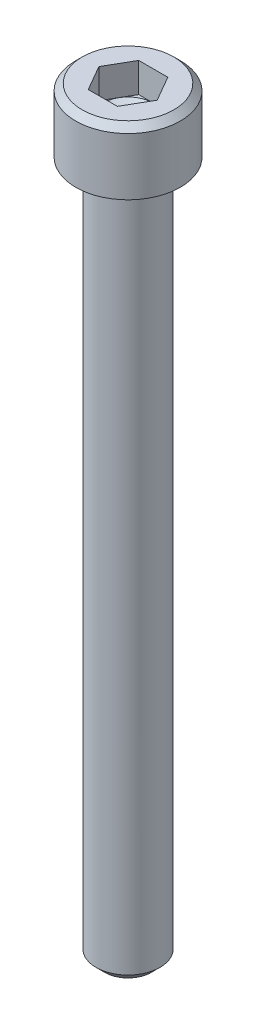
ISO-10303-21;
HEADER;
FILE_DESCRIPTION(('STEP AP214'),'2;1');
FILE_NAME('part.step','',(''),(''),'','','');
FILE_SCHEMA(('AUTOMOTIVE_DESIGN { 1 0 10303 214 1 1 1 1 }'));
ENDSEC;
DATA;
#1=APPLICATION_CONTEXT('core data for automotive mechanical design processes');
#2=APPLICATION_PROTOCOL_DEFINITION('international standard','automotive_design',2000,#1);
#3=PRODUCT_CONTEXT('',#1,'mechanical');
#4=PRODUCT('Part','Part','',(#3));
#5=PRODUCT_RELATED_PRODUCT_CATEGORY('part','',(#4));
#6=PRODUCT_DEFINITION_FORMATION('','',#4);
#7=PRODUCT_DEFINITION_CONTEXT('part definition',#1,'design');
#8=PRODUCT_DEFINITION('design','',#6,#7);
#9=PRODUCT_DEFINITION_SHAPE('','',#8);
#10=(LENGTH_UNIT() NAMED_UNIT(*) SI_UNIT(.MILLI.,.METRE.));
#11=(NAMED_UNIT(*) PLANE_ANGLE_UNIT() SI_UNIT($,.RADIAN.));
#12=(NAMED_UNIT(*) SI_UNIT($,.STERADIAN.) SOLID_ANGLE_UNIT());
#13=UNCERTAINTY_MEASURE_WITH_UNIT(LENGTH_MEASURE(1.E-05),#10,'distance_accuracy_value','');
#14=(GEOMETRIC_REPRESENTATION_CONTEXT(3) GLOBAL_UNCERTAINTY_ASSIGNED_CONTEXT((#13)) GLOBAL_UNIT_ASSIGNED_CONTEXT((#10,
#11,#12)) REPRESENTATION_CONTEXT('',''));
#15=CARTESIAN_POINT('',(0.,0.,0.));
#16=DIRECTION('',(0.,0.,1.));
#17=DIRECTION('',(1.,0.,0.));
#18=AXIS2_PLACEMENT_3D('',#15,#16,#17);
#19=CARTESIAN_POINT('',(0.,1.87959999988152,0.));
#20=DIRECTION('',(0.,1.,0.));
#21=DIRECTION('',(0.,0.,1.));
#22=AXIS2_PLACEMENT_3D('',#19,#20,#21);
#23=CONICAL_SURFACE('',#22,1.38429999981327,1.04719755105418);
#24=CARTESIAN_POINT('',(0.,1.08037402230821,-1.70530256582424E-10));
#25=VERTEX_POINT('',#24);
#26=VERTEX_LOOP('',#25);
#27=FACE_BOUND('',#26,.T.);
#28=CARTESIAN_POINT('',(0.,1.87959999997998,0.));
#29=DIRECTION('',(0.,1.,0.));
#30=DIRECTION('',(0.,0.,1.));
#31=AXIS2_PLACEMENT_3D('',#28,#29,#30);
#32=CIRCLE('',#31,1.3842999999838);
#33=CARTESIAN_POINT('',(-1.19883896645178,1.87959999998999,-0.692149999995953));
#34=VERTEX_POINT('',#33);
#35=CARTESIAN_POINT('',(0.,1.87959999998999,-1.3842999999919));
#36=VERTEX_POINT('',#35);
#37=EDGE_CURVE('E148',#34,#36,#32,.F.);
#38=ORIENTED_EDGE('',*,*,#37,.F.);
#39=CARTESIAN_POINT('',(0.,1.87959999997998,0.));
#40=DIRECTION('',(0.,1.,0.));
#41=DIRECTION('',(0.,0.,1.));
#42=AXIS2_PLACEMENT_3D('',#39,#40,#41);
#43=CIRCLE('',#42,1.3842999999838);
#44=CARTESIAN_POINT('',(-1.19883896645178,1.87959999998999,0.692149999995946));
#45=VERTEX_POINT('',#44);
#46=EDGE_CURVE('E95',#45,#34,#43,.F.);
#47=ORIENTED_EDGE('',*,*,#46,.F.);
#48=CARTESIAN_POINT('',(0.,1.87959999997998,0.));
#49=DIRECTION('',(0.,1.,0.));
#50=DIRECTION('',(0.,0.,1.));
#51=AXIS2_PLACEMENT_3D('',#48,#49,#50);
#52=CIRCLE('',#51,1.3842999999838);
#53=CARTESIAN_POINT('',(0.,1.87959999998999,1.3842999999919));
#54=VERTEX_POINT('',#53);
#55=EDGE_CURVE('E91',#54,#45,#52,.F.);
#56=ORIENTED_EDGE('',*,*,#55,.F.);
#57=CARTESIAN_POINT('',(0.,1.87959999997998,0.));
#58=DIRECTION('',(0.,1.,0.));
#59=DIRECTION('',(0.,0.,1.));
#60=AXIS2_PLACEMENT_3D('',#57,#58,#59);
#61=CIRCLE('',#60,1.3842999999838);
#62=CARTESIAN_POINT('',(1.19883896645178,1.87959999998999,0.692149999995948));
#63=VERTEX_POINT('',#62);
#64=EDGE_CURVE('E89',#63,#54,#61,.F.);
#65=ORIENTED_EDGE('',*,*,#64,.F.);
#66=CARTESIAN_POINT('',(0.,1.87959999997998,0.));
#67=DIRECTION('',(0.,1.,0.));
#68=DIRECTION('',(0.,0.,1.));
#69=AXIS2_PLACEMENT_3D('',#66,#67,#68);
#70=CIRCLE('',#69,1.3842999999838);
#71=CARTESIAN_POINT('',(1.19883896645178,1.87959999998999,-0.692149999995947));
#72=VERTEX_POINT('',#71);
#73=EDGE_CURVE('E19',#72,#63,#70,.F.);
#74=ORIENTED_EDGE('',*,*,#73,.F.);
#75=CARTESIAN_POINT('',(0.,1.87959999997998,0.));
#76=DIRECTION('',(0.,1.,0.));
#77=DIRECTION('',(0.,0.,1.));
#78=AXIS2_PLACEMENT_3D('',#75,#76,#77);
#79=CIRCLE('',#78,1.3842999999838);
#80=EDGE_CURVE('E106',#36,#72,#79,.F.);
#81=ORIENTED_EDGE('',*,*,#80,.F.);
#82=EDGE_LOOP('',(#38,#47,#56,#65,#74,#81));
#83=FACE_BOUND('',#82,.T.);
#84=ADVANCED_FACE('F16',(#27,#83),#23,.F.);
#85=CARTESIAN_POINT('',(0.,1.8796,0.));
#86=DIRECTION('',(0.,1.,0.));
#87=DIRECTION('',(0.,0.,1.));
#88=AXIS2_PLACEMENT_3D('',#85,#86,#87);
#89=PLANE('',#88);
#90=DIRECTION('',(0.500000000000001,0.,-0.866025403784438));
#91=VECTOR('',#90,1.);
#92=CARTESIAN_POINT('',(0.799225977639198,1.8796,1.3843));
#93=LINE('',#92,#91);
#94=CARTESIAN_POINT('',(1.5984519552784,1.8796,0.));
#95=VERTEX_POINT('',#94);
#96=EDGE_CURVE('E101',#63,#95,#93,.T.);
#97=ORIENTED_EDGE('',*,*,#96,.T.);
#98=DIRECTION('',(-0.499999999999999,0.,-0.866025403784439));
#99=VECTOR('',#98,1.);
#100=CARTESIAN_POINT('',(1.5984519552784,1.8796,0.));
#101=LINE('',#100,#99);
#102=EDGE_CURVE('E104',#95,#72,#101,.T.);
#103=ORIENTED_EDGE('',*,*,#102,.T.);
#104=ORIENTED_EDGE('',*,*,#73,.T.);
#105=EDGE_LOOP('',(#97,#103,#104));
#106=FACE_BOUND('',#105,.T.);
#107=ADVANCED_FACE('F99',(#106),#89,.T.);
#108=CARTESIAN_POINT('',(0.,1.8796,0.));
#109=DIRECTION('',(0.,1.,0.));
#110=DIRECTION('',(0.,0.,1.));
#111=AXIS2_PLACEMENT_3D('',#108,#109,#110);
#112=PLANE('',#111);
#113=DIRECTION('',(-0.499999999999999,0.,-0.866025403784439));
#114=VECTOR('',#113,1.);
#115=CARTESIAN_POINT('',(1.5984519552784,1.8796,0.));
#116=LINE('',#115,#114);
#117=CARTESIAN_POINT('',(0.799225977639201,1.8796,-1.3843));
#118=VERTEX_POINT('',#117);
#119=EDGE_CURVE('E115',#72,#118,#116,.T.);
#120=ORIENTED_EDGE('',*,*,#119,.T.);
#121=DIRECTION('',(-1.,0.,0.));
#122=VECTOR('',#121,1.);
#123=CARTESIAN_POINT('',(0.799225977639201,1.8796,-1.3843));
#124=LINE('',#123,#122);
#125=EDGE_CURVE('E155',#118,#36,#124,.T.);
#126=ORIENTED_EDGE('',*,*,#125,.T.);
#127=ORIENTED_EDGE('',*,*,#80,.T.);
#128=EDGE_LOOP('',(#120,#126,#127));
#129=FACE_BOUND('',#128,.T.);
#130=ADVANCED_FACE('F152',(#129),#112,.T.);
#131=CARTESIAN_POINT('',(0.,1.8796,0.));
#132=DIRECTION('',(0.,1.,0.));
#133=DIRECTION('',(0.,0.,1.));
#134=AXIS2_PLACEMENT_3D('',#131,#132,#133);
#135=PLANE('',#134);
#136=DIRECTION('',(-1.,0.,0.));
#137=VECTOR('',#136,1.);
#138=CARTESIAN_POINT('',(0.799225977639201,1.8796,-1.3843));
#139=LINE('',#138,#137);
#140=CARTESIAN_POINT('',(-0.799225977639195,1.8796,-1.3843));
#141=VERTEX_POINT('',#140);
#142=EDGE_CURVE('E160',#36,#141,#139,.T.);
#143=ORIENTED_EDGE('',*,*,#142,.T.);
#144=DIRECTION('',(-0.5,0.,0.866025403784438));
#145=VECTOR('',#144,1.);
#146=CARTESIAN_POINT('',(-0.799225977639195,1.8796,-1.3843));
#147=LINE('',#146,#145);
#148=EDGE_CURVE('E163',#141,#34,#147,.T.);
#149=ORIENTED_EDGE('',*,*,#148,.T.);
#150=ORIENTED_EDGE('',*,*,#37,.T.);
#151=EDGE_LOOP('',(#143,#149,#150));
#152=FACE_BOUND('',#151,.T.);
#153=ADVANCED_FACE('F159',(#152),#135,.T.);
#154=CARTESIAN_POINT('',(0.,1.8796,0.));
#155=DIRECTION('',(0.,1.,0.));
#156=DIRECTION('',(0.,0.,1.));
#157=AXIS2_PLACEMENT_3D('',#154,#155,#156);
#158=PLANE('',#157);
#159=DIRECTION('',(-0.5,0.,0.866025403784438));
#160=VECTOR('',#159,1.);
#161=CARTESIAN_POINT('',(-0.799225977639195,1.8796,-1.3843));
#162=LINE('',#161,#160);
#163=CARTESIAN_POINT('',(-1.5984519552784,1.8796,0.));
#164=VERTEX_POINT('',#163);
#165=EDGE_CURVE('E171',#34,#164,#162,.T.);
#166=ORIENTED_EDGE('',*,*,#165,.T.);
#167=DIRECTION('',(0.5,0.,0.866025403784439));
#168=VECTOR('',#167,1.);
#169=CARTESIAN_POINT('',(-1.5984519552784,1.8796,0.));
#170=LINE('',#169,#168);
#171=EDGE_CURVE('E230',#164,#45,#170,.T.);
#172=ORIENTED_EDGE('',*,*,#171,.T.);
#173=ORIENTED_EDGE('',*,*,#46,.T.);
#174=EDGE_LOOP('',(#166,#172,#173));
#175=FACE_BOUND('',#174,.T.);
#176=ADVANCED_FACE('F335',(#175),#158,.T.);
#177=CARTESIAN_POINT('',(0.,1.8796,0.));
#178=DIRECTION('',(0.,1.,0.));
#179=DIRECTION('',(0.,0.,1.));
#180=AXIS2_PLACEMENT_3D('',#177,#178,#179);
#181=PLANE('',#180);
#182=DIRECTION('',(1.,0.,0.));
#183=VECTOR('',#182,1.);
#184=CARTESIAN_POINT('',(-0.799225977639198,1.8796,1.3843));
#185=LINE('',#184,#183);
#186=CARTESIAN_POINT('',(0.799225977639198,1.8796,1.3843));
#187=VERTEX_POINT('',#186);
#188=EDGE_CURVE('E111',#54,#187,#185,.T.);
#189=ORIENTED_EDGE('',*,*,#188,.T.);
#190=DIRECTION('',(0.500000000000001,0.,-0.866025403784438));
#191=VECTOR('',#190,1.);
#192=CARTESIAN_POINT('',(0.799225977639198,1.8796,1.3843));
#193=LINE('',#192,#191);
#194=EDGE_CURVE('E108',#187,#63,#193,.T.);
#195=ORIENTED_EDGE('',*,*,#194,.T.);
#196=ORIENTED_EDGE('',*,*,#64,.T.);
#197=EDGE_LOOP('',(#189,#195,#196));
#198=FACE_BOUND('',#197,.T.);
#199=ADVANCED_FACE('F109',(#198),#181,.T.);
#200=CARTESIAN_POINT('',(0.,1.8796,0.));
#201=DIRECTION('',(0.,1.,0.));
#202=DIRECTION('',(0.,0.,1.));
#203=AXIS2_PLACEMENT_3D('',#200,#201,#202);
#204=PLANE('',#203);
#205=DIRECTION('',(0.5,0.,0.866025403784439));
#206=VECTOR('',#205,1.);
#207=CARTESIAN_POINT('',(-1.5984519552784,1.8796,0.));
#208=LINE('',#207,#206);
#209=CARTESIAN_POINT('',(-0.799225977639199,1.8796,1.3843));
#210=VERTEX_POINT('',#209);
#211=EDGE_CURVE('E167',#45,#210,#208,.T.);
#212=ORIENTED_EDGE('',*,*,#211,.T.);
#213=DIRECTION('',(1.,0.,0.));
#214=VECTOR('',#213,1.);
#215=CARTESIAN_POINT('',(-0.799225977639198,1.8796,1.3843));
#216=LINE('',#215,#214);
#217=EDGE_CURVE('E131',#210,#54,#216,.T.);
#218=ORIENTED_EDGE('',*,*,#217,.T.);
#219=ORIENTED_EDGE('',*,*,#55,.T.);
#220=EDGE_LOOP('',(#212,#218,#219));
#221=FACE_BOUND('',#220,.T.);
#222=ADVANCED_FACE('F329',(#221),#204,.T.);
#223=CARTESIAN_POINT('',(0.799225977639198,3.5052,1.3843));
#224=DIRECTION('',(0.866025403784438,0.,0.500000000000001));
#225=DIRECTION('',(0.500000000000001,0.,-0.866025403784438));
#226=AXIS2_PLACEMENT_3D('',#223,#224,#225);
#227=PLANE('',#226);
#228=DIRECTION('',(0.,1.,0.));
#229=VECTOR('',#228,1.);
#230=CARTESIAN_POINT('',(0.799225977639198,3.5052,1.3843));
#231=LINE('',#230,#229);
#232=CARTESIAN_POINT('',(0.799225977639198,3.5052,1.3843));
#233=VERTEX_POINT('',#232);
#234=EDGE_CURVE('E238',#187,#233,#231,.T.);
#235=ORIENTED_EDGE('',*,*,#234,.T.);
#236=DIRECTION('',(0.500000000000002,0.,-0.866025403784437));
#237=VECTOR('',#236,1.);
#238=CARTESIAN_POINT('',(0.799225977639198,3.5052,1.3843));
#239=LINE('',#238,#237);
#240=CARTESIAN_POINT('',(1.5984519552784,3.5052,0.));
#241=VERTEX_POINT('',#240);
#242=EDGE_CURVE('E128',#233,#241,#239,.T.);
#243=ORIENTED_EDGE('',*,*,#242,.T.);
#244=DIRECTION('',(0.,1.,0.));
#245=VECTOR('',#244,1.);
#246=CARTESIAN_POINT('',(1.5984519552784,3.5052,0.));
#247=LINE('',#246,#245);
#248=EDGE_CURVE('E119',#241,#95,#247,.F.);
#249=ORIENTED_EDGE('',*,*,#248,.T.);
#250=ORIENTED_EDGE('',*,*,#96,.F.);
#251=ORIENTED_EDGE('',*,*,#194,.F.);
#252=EDGE_LOOP('',(#235,#243,#249,#250,#251));
#253=FACE_BOUND('',#252,.T.);
#254=ADVANCED_FACE('F117',(#253),#227,.F.);
#255=CARTESIAN_POINT('',(1.5984519552784,3.5052,0.));
#256=DIRECTION('',(0.866025403784439,0.,-0.499999999999999));
#257=DIRECTION('',(-0.499999999999999,0.,-0.866025403784439));
#258=AXIS2_PLACEMENT_3D('',#255,#256,#257);
#259=PLANE('',#258);
#260=ORIENTED_EDGE('',*,*,#248,.F.);
#261=DIRECTION('',(-0.5,0.,-0.866025403784439));
#262=VECTOR('',#261,1.);
#263=CARTESIAN_POINT('',(1.5984519552784,3.5052,0.));
#264=LINE('',#263,#262);
#265=CARTESIAN_POINT('',(0.799225977639201,3.5052,-1.3843));
#266=VERTEX_POINT('',#265);
#267=EDGE_CURVE('E130',#241,#266,#264,.T.);
#268=ORIENTED_EDGE('',*,*,#267,.T.);
#269=DIRECTION('',(0.,1.,0.));
#270=VECTOR('',#269,1.);
#271=CARTESIAN_POINT('',(0.799225977639201,3.5052,-1.3843));
#272=LINE('',#271,#270);
#273=EDGE_CURVE('E179',#266,#118,#272,.F.);
#274=ORIENTED_EDGE('',*,*,#273,.T.);
#275=ORIENTED_EDGE('',*,*,#119,.F.);
#276=ORIENTED_EDGE('',*,*,#102,.F.);
#277=EDGE_LOOP('',(#260,#268,#274,#275,#276));
#278=FACE_BOUND('',#277,.T.);
#279=ADVANCED_FACE('F218',(#278),#259,.F.);
#280=CARTESIAN_POINT('',(0.799225977639201,3.5052,-1.3843));
#281=DIRECTION('',(0.,0.,-1.));
#282=DIRECTION('',(-1.,0.,0.));
#283=AXIS2_PLACEMENT_3D('',#280,#281,#282);
#284=PLANE('',#283);
#285=ORIENTED_EDGE('',*,*,#273,.F.);
#286=DIRECTION('',(1.,0.,0.));
#287=VECTOR('',#286,1.);
#288=CARTESIAN_POINT('',(0.,3.5052,-1.3843));
#289=LINE('',#288,#287);
#290=CARTESIAN_POINT('',(-0.799225977639195,3.5052,-1.3843));
#291=VERTEX_POINT('',#290);
#292=EDGE_CURVE('E189',#266,#291,#289,.F.);
#293=ORIENTED_EDGE('',*,*,#292,.T.);
#294=DIRECTION('',(0.,1.,0.));
#295=VECTOR('',#294,1.);
#296=CARTESIAN_POINT('',(-0.799225977639195,3.5052,-1.3843));
#297=LINE('',#296,#295);
#298=EDGE_CURVE('E168',#291,#141,#297,.F.);
#299=ORIENTED_EDGE('',*,*,#298,.T.);
#300=ORIENTED_EDGE('',*,*,#142,.F.);
#301=ORIENTED_EDGE('',*,*,#125,.F.);
#302=EDGE_LOOP('',(#285,#293,#299,#300,#301));
#303=FACE_BOUND('',#302,.T.);
#304=ADVANCED_FACE('F223',(#303),#284,.F.);
#305=CARTESIAN_POINT('',(-0.799225977639195,3.5052,-1.3843));
#306=DIRECTION('',(-0.866025403784438,0.,-0.5));
#307=DIRECTION('',(-0.5,0.,0.866025403784438));
#308=AXIS2_PLACEMENT_3D('',#305,#306,#307);
#309=PLANE('',#308);
#310=ORIENTED_EDGE('',*,*,#298,.F.);
#311=DIRECTION('',(-0.500000000000003,0.,0.866025403784437));
#312=VECTOR('',#311,1.);
#313=CARTESIAN_POINT('',(-0.799225977639195,3.5052,-1.3843));
#314=LINE('',#313,#312);
#315=CARTESIAN_POINT('',(-1.5984519552784,3.5052,0.));
#316=VERTEX_POINT('',#315);
#317=EDGE_CURVE('E187',#291,#316,#314,.T.);
#318=ORIENTED_EDGE('',*,*,#317,.T.);
#319=DIRECTION('',(0.,1.,0.));
#320=VECTOR('',#319,1.);
#321=CARTESIAN_POINT('',(-1.5984519552784,3.5052,0.));
#322=LINE('',#321,#320);
#323=EDGE_CURVE('E173',#316,#164,#322,.F.);
#324=ORIENTED_EDGE('',*,*,#323,.T.);
#325=ORIENTED_EDGE('',*,*,#165,.F.);
#326=ORIENTED_EDGE('',*,*,#148,.F.);
#327=EDGE_LOOP('',(#310,#318,#324,#325,#326));
#328=FACE_BOUND('',#327,.T.);
#329=ADVANCED_FACE('F172',(#328),#309,.F.);
#330=CARTESIAN_POINT('',(-1.5984519552784,3.5052,0.));
#331=DIRECTION('',(-0.866025403784439,0.,0.5));
#332=DIRECTION('',(0.5,0.,0.866025403784439));
#333=AXIS2_PLACEMENT_3D('',#330,#331,#332);
#334=PLANE('',#333);
#335=ORIENTED_EDGE('',*,*,#323,.F.);
#336=DIRECTION('',(0.500000000000001,0.,0.866025403784438));
#337=VECTOR('',#336,1.);
#338=CARTESIAN_POINT('',(-1.5984519552784,3.5052,0.));
#339=LINE('',#338,#337);
#340=CARTESIAN_POINT('',(-0.799225977639198,3.5052,1.3843));
#341=VERTEX_POINT('',#340);
#342=EDGE_CURVE('E34',#316,#341,#339,.T.);
#343=ORIENTED_EDGE('',*,*,#342,.T.);
#344=DIRECTION('',(0.,1.,0.));
#345=VECTOR('',#344,1.);
#346=CARTESIAN_POINT('',(-0.799225977639198,3.5052,1.3843));
#347=LINE('',#346,#345);
#348=EDGE_CURVE('E240',#341,#210,#347,.F.);
#349=ORIENTED_EDGE('',*,*,#348,.T.);
#350=ORIENTED_EDGE('',*,*,#211,.F.);
#351=ORIENTED_EDGE('',*,*,#171,.F.);
#352=EDGE_LOOP('',(#335,#343,#349,#350,#351));
#353=FACE_BOUND('',#352,.T.);
#354=ADVANCED_FACE('F228',(#353),#334,.F.);
#355=CARTESIAN_POINT('',(-0.799225977639198,3.5052,1.3843));
#356=DIRECTION('',(0.,0.,1.));
#357=DIRECTION('',(1.,0.,0.));
#358=AXIS2_PLACEMENT_3D('',#355,#356,#357);
#359=PLANE('',#358);
#360=ORIENTED_EDGE('',*,*,#348,.F.);
#361=DIRECTION('',(1.,0.,0.));
#362=VECTOR('',#361,1.);
#363=CARTESIAN_POINT('',(0.,3.5052,1.3843));
#364=LINE('',#363,#362);
#365=EDGE_CURVE('E144',#341,#233,#364,.T.);
#366=ORIENTED_EDGE('',*,*,#365,.T.);
#367=ORIENTED_EDGE('',*,*,#234,.F.);
#368=ORIENTED_EDGE('',*,*,#188,.F.);
#369=ORIENTED_EDGE('',*,*,#217,.F.);
#370=EDGE_LOOP('',(#360,#366,#367,#368,#369));
#371=FACE_BOUND('',#370,.T.);
#372=ADVANCED_FACE('F315',(#371),#359,.F.);
#373=CARTESIAN_POINT('',(0.,3.5052,0.));
#374=DIRECTION('',(0.,-1.,0.));
#375=DIRECTION('',(0.,0.,-1.));
#376=AXIS2_PLACEMENT_3D('',#373,#374,#375);
#377=PLANE('',#376);
#378=ORIENTED_EDGE('',*,*,#342,.F.);
#379=ORIENTED_EDGE('',*,*,#317,.F.);
#380=ORIENTED_EDGE('',*,*,#292,.F.);
#381=ORIENTED_EDGE('',*,*,#267,.F.);
#382=ORIENTED_EDGE('',*,*,#242,.F.);
#383=ORIENTED_EDGE('',*,*,#365,.F.);
#384=EDGE_LOOP('',(#378,#379,#380,#381,#382,#383));
#385=FACE_BOUND('',#384,.T.);
#386=CARTESIAN_POINT('',(0.,3.50519999994958,0.));
#387=DIRECTION('',(0.,-1.,0.));
#388=DIRECTION('',(0.,0.,-1.));
#389=AXIS2_PLACEMENT_3D('',#386,#387,#388);
#390=CIRCLE('',#389,2.51460000004045);
#391=CARTESIAN_POINT('',(0.,3.50519999994958,-2.51460000004045));
#392=VERTEX_POINT('',#391);
#393=EDGE_CURVE('E142',#392,#392,#390,.T.);
#394=ORIENTED_EDGE('',*,*,#393,.F.);
#395=EDGE_LOOP('',(#394));
#396=FACE_BOUND('',#395,.T.);
#397=ADVANCED_FACE('F225',(#385,#396),#377,.F.);
#398=CARTESIAN_POINT('',(0.,3.14960000002884,0.));
#399=DIRECTION('',(0.,-1.,0.));
#400=DIRECTION('',(0.,0.,-1.));
#401=AXIS2_PLACEMENT_3D('',#398,#399,#400);
#402=CONICAL_SURFACE('',#401,2.87020000001803,0.785398163477374);
#403=CARTESIAN_POINT('',(0.,3.1496,0.));
#404=DIRECTION('',(0.,-1.,0.));
#405=DIRECTION('',(0.,0.,-1.));
#406=AXIS2_PLACEMENT_3D('',#403,#404,#405);
#407=CIRCLE('',#406,2.8702);
#408=CARTESIAN_POINT('',(0.,3.1496,-2.8702));
#409=VERTEX_POINT('',#408);
#410=EDGE_CURVE('E141',#409,#409,#407,.T.);
#411=ORIENTED_EDGE('',*,*,#410,.F.);
#412=EDGE_LOOP('',(#411));
#413=FACE_BOUND('',#412,.T.);
#414=ORIENTED_EDGE('',*,*,#393,.T.);
#415=EDGE_LOOP('',(#414));
#416=FACE_BOUND('',#415,.T.);
#417=ADVANCED_FACE('F308',(#413,#416),#402,.T.);
#418=CARTESIAN_POINT('',(0.,5.58546,0.));
#419=DIRECTION('',(0.,-1.,0.));
#420=DIRECTION('',(0.,0.,-1.));
#421=AXIS2_PLACEMENT_3D('',#418,#419,#420);
#422=CYLINDRICAL_SURFACE('',#421,2.8702);
#423=CARTESIAN_POINT('',(0.,0.,0.));
#424=DIRECTION('',(0.,-1.,0.));
#425=DIRECTION('',(0.,0.,-1.));
#426=AXIS2_PLACEMENT_3D('',#423,#424,#425);
#427=CIRCLE('',#426,2.8702);
#428=CARTESIAN_POINT('',(0.,0.,-2.8702));
#429=VERTEX_POINT('',#428);
#430=EDGE_CURVE('E138',#429,#429,#427,.T.);
#431=ORIENTED_EDGE('',*,*,#430,.F.);
#432=EDGE_LOOP('',(#431));
#433=FACE_BOUND('',#432,.T.);
#434=ORIENTED_EDGE('',*,*,#410,.T.);
#435=EDGE_LOOP('',(#434));
#436=FACE_BOUND('',#435,.T.);
#437=ADVANCED_FACE('F305',(#433,#436),#422,.T.);
#438=CARTESIAN_POINT('',(0.,0.,0.));
#439=DIRECTION('',(0.,-1.,0.));
#440=DIRECTION('',(0.,0.,-1.));
#441=AXIS2_PLACEMENT_3D('',#438,#439,#440);
#442=PLANE('',#441);
#443=CARTESIAN_POINT('',(0.,0.,0.));
#444=DIRECTION('',(0.,-1.,0.));
#445=DIRECTION('',(-1.,0.,-3.20523991131182E-11));
#446=AXIS2_PLACEMENT_3D('',#443,#444,#445);
#447=CIRCLE('',#446,2.0066);
#448=CARTESIAN_POINT('',(-2.0066,0.,-6.43163440603831E-11));
#449=VERTEX_POINT('',#448);
#450=EDGE_CURVE('E137',#449,#449,#447,.F.);
#451=ORIENTED_EDGE('',*,*,#450,.T.);
#452=EDGE_LOOP('',(#451));
#453=FACE_BOUND('',#452,.T.);
#454=ORIENTED_EDGE('',*,*,#430,.T.);
#455=EDGE_LOOP('',(#454));
#456=FACE_BOUND('',#455,.T.);
#457=ADVANCED_FACE('F296',(#453,#456),#442,.T.);
#458=CARTESIAN_POINT('',(0.,-38.1,0.));
#459=DIRECTION('',(0.,-1.,0.));
#460=DIRECTION('',(0.,0.,-1.));
#461=AXIS2_PLACEMENT_3D('',#458,#459,#460);
#462=PLANE('',#461);
#463=CARTESIAN_POINT('',(0.,-38.0999999999858,0.));
#464=DIRECTION('',(0.,1.,0.));
#465=DIRECTION('',(0.,0.,1.));
#466=AXIS2_PLACEMENT_3D('',#463,#464,#465);
#467=CIRCLE('',#466,1.28016000002162);
#468=CARTESIAN_POINT('',(0.,-38.0999999999858,1.28016000002162));
#469=VERTEX_POINT('',#468);
#470=EDGE_CURVE('E134',#469,#469,#467,.T.);
#471=ORIENTED_EDGE('',*,*,#470,.F.);
#472=EDGE_LOOP('',(#471));
#473=FACE_BOUND('',#472,.T.);
#474=ADVANCED_FACE('F283',(#473),#462,.T.);
#475=CARTESIAN_POINT('',(0.,-0.254,0.));
#476=DIRECTION('',(0.,-1.,0.));
#477=DIRECTION('',(0.,0.,-1.));
#478=AXIS2_PLACEMENT_3D('',#475,#476,#477);
#479=TOROIDAL_SURFACE('',#478,2.0066,0.254);
#480=CARTESIAN_POINT('',(0.,-0.254,0.));
#481=DIRECTION('',(0.,-1.,0.));
#482=DIRECTION('',(0.,0.,-1.));
#483=AXIS2_PLACEMENT_3D('',#480,#481,#482);
#484=CIRCLE('',#483,1.7526);
#485=CARTESIAN_POINT('',(0.,-0.254,-1.7526));
#486=VERTEX_POINT('',#485);
#487=EDGE_CURVE('E25',#486,#486,#484,.T.);
#488=ORIENTED_EDGE('',*,*,#487,.F.);
#489=EDGE_LOOP('',(#488));
#490=FACE_BOUND('',#489,.T.);
#491=ORIENTED_EDGE('',*,*,#450,.F.);
#492=EDGE_LOOP('',(#491));
#493=FACE_BOUND('',#492,.T.);
#494=ADVANCED_FACE('F271',(#490,#493),#479,.F.);
#495=CARTESIAN_POINT('',(0.,-37.6275600000326,0.));
#496=DIRECTION('',(0.,1.,0.));
#497=DIRECTION('',(0.,0.,1.));
#498=AXIS2_PLACEMENT_3D('',#495,#496,#497);
#499=CONICAL_SURFACE('',#498,1.75259999997479,0.785398163397448);
#500=ORIENTED_EDGE('',*,*,#470,.T.);
#501=EDGE_LOOP('',(#500));
#502=FACE_BOUND('',#501,.T.);
#503=CARTESIAN_POINT('',(0.,-37.62756,0.));
#504=DIRECTION('',(0.,-1.,0.));
#505=DIRECTION('',(0.,0.,-1.));
#506=AXIS2_PLACEMENT_3D('',#503,#504,#505);
#507=CIRCLE('',#506,1.7526);
#508=CARTESIAN_POINT('',(0.,-37.62756,-1.7526));
#509=VERTEX_POINT('',#508);
#510=EDGE_CURVE('E11',#509,#509,#507,.F.);
#511=ORIENTED_EDGE('',*,*,#510,.F.);
#512=EDGE_LOOP('',(#511));
#513=FACE_BOUND('',#512,.T.);
#514=ADVANCED_FACE('F282',(#502,#513),#499,.T.);
#515=CARTESIAN_POINT('',(0.,5.58546,0.));
#516=DIRECTION('',(0.,-1.,0.));
#517=DIRECTION('',(0.,0.,-1.));
#518=AXIS2_PLACEMENT_3D('',#515,#516,#517);
#519=CYLINDRICAL_SURFACE('',#518,1.7526);
#520=ORIENTED_EDGE('',*,*,#510,.T.);
#521=EDGE_LOOP('',(#520));
#522=FACE_BOUND('',#521,.T.);
#523=ORIENTED_EDGE('',*,*,#487,.T.);
#524=EDGE_LOOP('',(#523));
#525=FACE_BOUND('',#524,.T.);
#526=ADVANCED_FACE('F347',(#522,#525),#519,.T.);
#527=CLOSED_SHELL('',(#84,#107,#130,#153,#176,#199,#222,#254,#279,#304,#329,#354,#372,#397,#417,
#437,#457,#474,#494,#514,#526));
#528=MANIFOLD_SOLID_BREP('B1',#527);
#529=ADVANCED_BREP_SHAPE_REPRESENTATION('',(#18,#528),#14);
#530=SHAPE_DEFINITION_REPRESENTATION(#9,#529);
ENDSEC;
END-ISO-10303-21;
